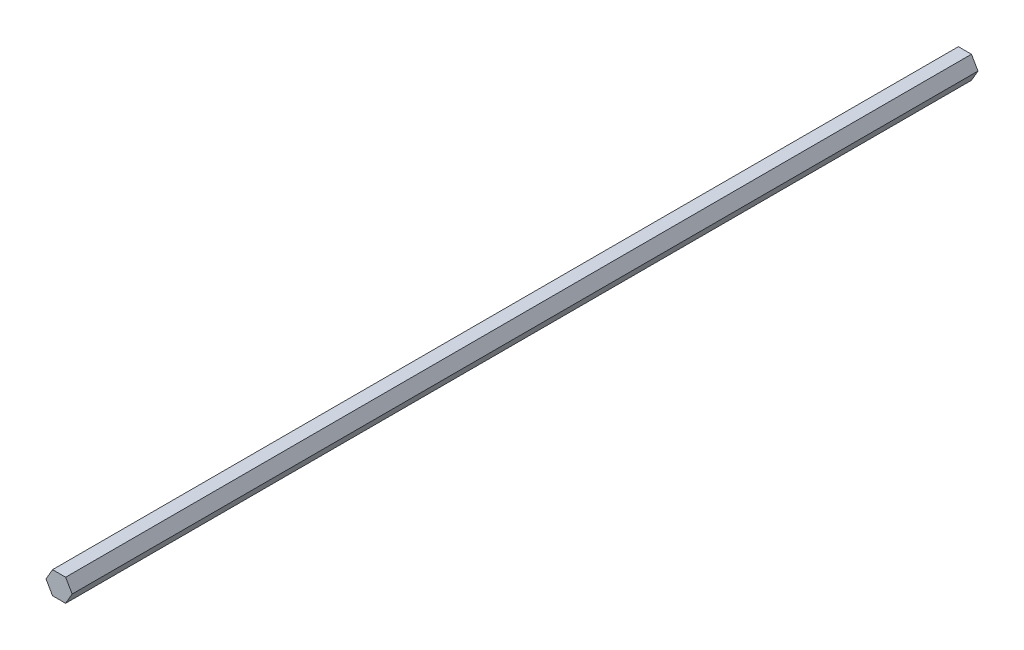
ISO-10303-21;
HEADER;
FILE_DESCRIPTION(('STEP AP214'),'2;1');
FILE_NAME('part.step','',(''),(''),'','','');
FILE_SCHEMA(('AUTOMOTIVE_DESIGN { 1 0 10303 214 1 1 1 1 }'));
ENDSEC;
DATA;
#1=APPLICATION_CONTEXT('core data for automotive mechanical design processes');
#2=APPLICATION_PROTOCOL_DEFINITION('international standard','automotive_design',2000,#1);
#3=PRODUCT_CONTEXT('',#1,'mechanical');
#4=PRODUCT('Part','Part','',(#3));
#5=PRODUCT_RELATED_PRODUCT_CATEGORY('part','',(#4));
#6=PRODUCT_DEFINITION_FORMATION('','',#4);
#7=PRODUCT_DEFINITION_CONTEXT('part definition',#1,'design');
#8=PRODUCT_DEFINITION('design','',#6,#7);
#9=PRODUCT_DEFINITION_SHAPE('','',#8);
#10=(LENGTH_UNIT() NAMED_UNIT(*) SI_UNIT(.MILLI.,.METRE.));
#11=(NAMED_UNIT(*) PLANE_ANGLE_UNIT() SI_UNIT($,.RADIAN.));
#12=(NAMED_UNIT(*) SI_UNIT($,.STERADIAN.) SOLID_ANGLE_UNIT());
#13=UNCERTAINTY_MEASURE_WITH_UNIT(LENGTH_MEASURE(1.E-05),#10,'distance_accuracy_value','');
#14=(GEOMETRIC_REPRESENTATION_CONTEXT(3) GLOBAL_UNCERTAINTY_ASSIGNED_CONTEXT((#13)) GLOBAL_UNIT_ASSIGNED_CONTEXT((#10,
#11,#12)) REPRESENTATION_CONTEXT('',''));
#15=CARTESIAN_POINT('',(0.,0.,0.));
#16=DIRECTION('',(0.,0.,1.));
#17=DIRECTION('',(1.,0.,0.));
#18=AXIS2_PLACEMENT_3D('',#15,#16,#17);
#19=CARTESIAN_POINT('',(3.66617420935412,6.35,508.));
#20=DIRECTION('',(0.,-1.,0.));
#21=DIRECTION('',(0.,0.,-1.));
#22=AXIS2_PLACEMENT_3D('',#19,#20,#21);
#23=PLANE('',#22);
#24=DIRECTION('',(-1.,0.,0.));
#25=VECTOR('',#24,1.);
#26=CARTESIAN_POINT('',(3.66617420935412,6.35,0.));
#27=LINE('',#26,#25);
#28=CARTESIAN_POINT('',(3.66617420935412,6.35,0.));
#29=VERTEX_POINT('',#28);
#30=CARTESIAN_POINT('',(-3.66617420935412,6.35,0.));
#31=VERTEX_POINT('',#30);
#32=EDGE_CURVE('E118',#29,#31,#27,.T.);
#33=ORIENTED_EDGE('',*,*,#32,.T.);
#34=DIRECTION('',(0.,0.,-1.));
#35=VECTOR('',#34,1.);
#36=CARTESIAN_POINT('',(-3.66617420935412,6.35,508.));
#37=LINE('',#36,#35);
#38=CARTESIAN_POINT('',(-3.66617420935412,6.35,508.));
#39=VERTEX_POINT('',#38);
#40=EDGE_CURVE('E11',#39,#31,#37,.T.);
#41=ORIENTED_EDGE('',*,*,#40,.F.);
#42=DIRECTION('',(-1.,0.,0.));
#43=VECTOR('',#42,1.);
#44=CARTESIAN_POINT('',(3.66617420935412,6.35,508.));
#45=LINE('',#44,#43);
#46=CARTESIAN_POINT('',(3.66617420935412,6.35,508.));
#47=VERTEX_POINT('',#46);
#48=EDGE_CURVE('E128',#47,#39,#45,.T.);
#49=ORIENTED_EDGE('',*,*,#48,.F.);
#50=DIRECTION('',(0.,0.,-1.));
#51=VECTOR('',#50,1.);
#52=CARTESIAN_POINT('',(3.66617420935412,6.35,508.));
#53=LINE('',#52,#51);
#54=EDGE_CURVE('E114',#47,#29,#53,.T.);
#55=ORIENTED_EDGE('',*,*,#54,.T.);
#56=EDGE_LOOP('',(#33,#41,#49,#55));
#57=FACE_BOUND('',#56,.T.);
#58=ADVANCED_FACE('F34',(#57),#23,.F.);
#59=CARTESIAN_POINT('',(-3.66617420935412,6.35,508.));
#60=DIRECTION('',(0.866025403784439,-0.5,0.));
#61=DIRECTION('',(0.5,0.866025403784439,0.));
#62=AXIS2_PLACEMENT_3D('',#59,#60,#61);
#63=PLANE('',#62);
#64=DIRECTION('',(-0.5,-0.866025403784439,0.));
#65=VECTOR('',#64,1.);
#66=CARTESIAN_POINT('',(-3.66617420935412,6.35,0.));
#67=LINE('',#66,#65);
#68=CARTESIAN_POINT('',(-7.33234841870825,0.,0.));
#69=VERTEX_POINT('',#68);
#70=EDGE_CURVE('E121',#31,#69,#67,.T.);
#71=ORIENTED_EDGE('',*,*,#70,.T.);
#72=DIRECTION('',(0.,0.,-1.));
#73=VECTOR('',#72,1.);
#74=CARTESIAN_POINT('',(-7.33234841870825,0.,508.));
#75=LINE('',#74,#73);
#76=CARTESIAN_POINT('',(-7.33234841870825,0.,508.));
#77=VERTEX_POINT('',#76);
#78=EDGE_CURVE('E42',#77,#69,#75,.T.);
#79=ORIENTED_EDGE('',*,*,#78,.F.);
#80=DIRECTION('',(-0.5,-0.866025403784439,0.));
#81=VECTOR('',#80,1.);
#82=CARTESIAN_POINT('',(-3.66617420935412,6.35,508.));
#83=LINE('',#82,#81);
#84=EDGE_CURVE('E87',#39,#77,#83,.T.);
#85=ORIENTED_EDGE('',*,*,#84,.F.);
#86=ORIENTED_EDGE('',*,*,#40,.T.);
#87=EDGE_LOOP('',(#71,#79,#85,#86));
#88=FACE_BOUND('',#87,.T.);
#89=ADVANCED_FACE('F152',(#88),#63,.F.);
#90=CARTESIAN_POINT('',(-7.33234841870825,0.,508.));
#91=DIRECTION('',(0.866025403784439,0.5,0.));
#92=DIRECTION('',(-0.5,0.866025403784439,0.));
#93=AXIS2_PLACEMENT_3D('',#90,#91,#92);
#94=PLANE('',#93);
#95=DIRECTION('',(0.5,-0.866025403784439,0.));
#96=VECTOR('',#95,1.);
#97=CARTESIAN_POINT('',(-7.33234841870825,0.,0.));
#98=LINE('',#97,#96);
#99=CARTESIAN_POINT('',(-3.66617420935412,-6.35,0.));
#100=VERTEX_POINT('',#99);
#101=EDGE_CURVE('E123',#69,#100,#98,.T.);
#102=ORIENTED_EDGE('',*,*,#101,.T.);
#103=DIRECTION('',(0.,0.,-1.));
#104=VECTOR('',#103,1.);
#105=CARTESIAN_POINT('',(-3.66617420935412,-6.35,508.));
#106=LINE('',#105,#104);
#107=CARTESIAN_POINT('',(-3.66617420935412,-6.35,508.));
#108=VERTEX_POINT('',#107);
#109=EDGE_CURVE('E109',#108,#100,#106,.T.);
#110=ORIENTED_EDGE('',*,*,#109,.F.);
#111=DIRECTION('',(0.5,-0.866025403784439,0.));
#112=VECTOR('',#111,1.);
#113=CARTESIAN_POINT('',(-7.33234841870825,0.,508.));
#114=LINE('',#113,#112);
#115=EDGE_CURVE('E100',#77,#108,#114,.T.);
#116=ORIENTED_EDGE('',*,*,#115,.F.);
#117=ORIENTED_EDGE('',*,*,#78,.T.);
#118=EDGE_LOOP('',(#102,#110,#116,#117));
#119=FACE_BOUND('',#118,.T.);
#120=ADVANCED_FACE('F134',(#119),#94,.F.);
#121=CARTESIAN_POINT('',(-3.66617420935412,-6.35,508.));
#122=DIRECTION('',(0.,1.,0.));
#123=DIRECTION('',(-1.,0.,0.));
#124=AXIS2_PLACEMENT_3D('',#121,#122,#123);
#125=PLANE('',#124);
#126=DIRECTION('',(1.,0.,0.));
#127=VECTOR('',#126,1.);
#128=CARTESIAN_POINT('',(-3.66617420935412,-6.35,0.));
#129=LINE('',#128,#127);
#130=CARTESIAN_POINT('',(3.66617420935412,-6.35,0.));
#131=VERTEX_POINT('',#130);
#132=EDGE_CURVE('E108',#100,#131,#129,.T.);
#133=ORIENTED_EDGE('',*,*,#132,.T.);
#134=DIRECTION('',(0.,0.,-1.));
#135=VECTOR('',#134,1.);
#136=CARTESIAN_POINT('',(3.66617420935412,-6.35,508.));
#137=LINE('',#136,#135);
#138=CARTESIAN_POINT('',(3.66617420935412,-6.35,508.));
#139=VERTEX_POINT('',#138);
#140=EDGE_CURVE('E105',#139,#131,#137,.T.);
#141=ORIENTED_EDGE('',*,*,#140,.F.);
#142=DIRECTION('',(1.,0.,0.));
#143=VECTOR('',#142,1.);
#144=CARTESIAN_POINT('',(-3.66617420935412,-6.35,508.));
#145=LINE('',#144,#143);
#146=EDGE_CURVE('E94',#108,#139,#145,.T.);
#147=ORIENTED_EDGE('',*,*,#146,.F.);
#148=ORIENTED_EDGE('',*,*,#109,.T.);
#149=EDGE_LOOP('',(#133,#141,#147,#148));
#150=FACE_BOUND('',#149,.T.);
#151=ADVANCED_FACE('F106',(#150),#125,.F.);
#152=CARTESIAN_POINT('',(3.66617420935412,-6.35,508.));
#153=DIRECTION('',(-0.866025403784439,0.5,0.));
#154=DIRECTION('',(-0.5,-0.866025403784439,0.));
#155=AXIS2_PLACEMENT_3D('',#152,#153,#154);
#156=PLANE('',#155);
#157=DIRECTION('',(0.5,0.866025403784439,0.));
#158=VECTOR('',#157,1.);
#159=CARTESIAN_POINT('',(3.66617420935412,-6.35,0.));
#160=LINE('',#159,#158);
#161=CARTESIAN_POINT('',(7.33234841870825,0.,0.));
#162=VERTEX_POINT('',#161);
#163=EDGE_CURVE('E73',#131,#162,#160,.T.);
#164=ORIENTED_EDGE('',*,*,#163,.T.);
#165=DIRECTION('',(0.,0.,-1.));
#166=VECTOR('',#165,1.);
#167=CARTESIAN_POINT('',(7.33234841870825,0.,508.));
#168=LINE('',#167,#166);
#169=CARTESIAN_POINT('',(7.33234841870825,0.,508.));
#170=VERTEX_POINT('',#169);
#171=EDGE_CURVE('E110',#170,#162,#168,.T.);
#172=ORIENTED_EDGE('',*,*,#171,.F.);
#173=DIRECTION('',(0.5,0.866025403784439,0.));
#174=VECTOR('',#173,1.);
#175=CARTESIAN_POINT('',(3.66617420935412,-6.35,508.));
#176=LINE('',#175,#174);
#177=EDGE_CURVE('E98',#139,#170,#176,.T.);
#178=ORIENTED_EDGE('',*,*,#177,.F.);
#179=ORIENTED_EDGE('',*,*,#140,.T.);
#180=EDGE_LOOP('',(#164,#172,#178,#179));
#181=FACE_BOUND('',#180,.T.);
#182=ADVANCED_FACE('F112',(#181),#156,.F.);
#183=CARTESIAN_POINT('',(7.33234841870825,0.,508.));
#184=DIRECTION('',(-0.866025403784439,-0.5,0.));
#185=DIRECTION('',(0.5,-0.866025403784439,0.));
#186=AXIS2_PLACEMENT_3D('',#183,#184,#185);
#187=PLANE('',#186);
#188=DIRECTION('',(-0.5,0.866025403784439,0.));
#189=VECTOR('',#188,1.);
#190=CARTESIAN_POINT('',(7.33234841870825,0.,0.));
#191=LINE('',#190,#189);
#192=EDGE_CURVE('E79',#162,#29,#191,.T.);
#193=ORIENTED_EDGE('',*,*,#192,.T.);
#194=ORIENTED_EDGE('',*,*,#54,.F.);
#195=DIRECTION('',(-0.5,0.866025403784439,0.));
#196=VECTOR('',#195,1.);
#197=CARTESIAN_POINT('',(7.33234841870825,0.,508.));
#198=LINE('',#197,#196);
#199=EDGE_CURVE('E50',#170,#47,#198,.T.);
#200=ORIENTED_EDGE('',*,*,#199,.F.);
#201=ORIENTED_EDGE('',*,*,#171,.T.);
#202=EDGE_LOOP('',(#193,#194,#200,#201));
#203=FACE_BOUND('',#202,.T.);
#204=ADVANCED_FACE('F141',(#203),#187,.F.);
#205=CARTESIAN_POINT('',(0.,0.,508.));
#206=DIRECTION('',(0.,0.,1.));
#207=DIRECTION('',(1.,0.,0.));
#208=AXIS2_PLACEMENT_3D('',#205,#206,#207);
#209=PLANE('',#208);
#210=ORIENTED_EDGE('',*,*,#48,.T.);
#211=ORIENTED_EDGE('',*,*,#84,.T.);
#212=ORIENTED_EDGE('',*,*,#115,.T.);
#213=ORIENTED_EDGE('',*,*,#146,.T.);
#214=ORIENTED_EDGE('',*,*,#177,.T.);
#215=ORIENTED_EDGE('',*,*,#199,.T.);
#216=EDGE_LOOP('',(#210,#211,#212,#213,#214,#215));
#217=FACE_BOUND('',#216,.T.);
#218=ADVANCED_FACE('F96',(#217),#209,.T.);
#219=CARTESIAN_POINT('',(0.,0.,0.));
#220=DIRECTION('',(0.,0.,1.));
#221=DIRECTION('',(1.,0.,0.));
#222=AXIS2_PLACEMENT_3D('',#219,#220,#221);
#223=PLANE('',#222);
#224=ORIENTED_EDGE('',*,*,#32,.F.);
#225=ORIENTED_EDGE('',*,*,#192,.F.);
#226=ORIENTED_EDGE('',*,*,#163,.F.);
#227=ORIENTED_EDGE('',*,*,#132,.F.);
#228=ORIENTED_EDGE('',*,*,#101,.F.);
#229=ORIENTED_EDGE('',*,*,#70,.F.);
#230=EDGE_LOOP('',(#224,#225,#226,#227,#228,#229));
#231=FACE_BOUND('',#230,.T.);
#232=ADVANCED_FACE('F137',(#231),#223,.F.);
#233=CLOSED_SHELL('',(#58,#89,#120,#151,#182,#204,#218,#232));
#234=MANIFOLD_SOLID_BREP('B2',#233);
#235=ADVANCED_BREP_SHAPE_REPRESENTATION('',(#18,#234),#14);
#236=SHAPE_DEFINITION_REPRESENTATION(#9,#235);
ENDSEC;
END-ISO-10303-21;
